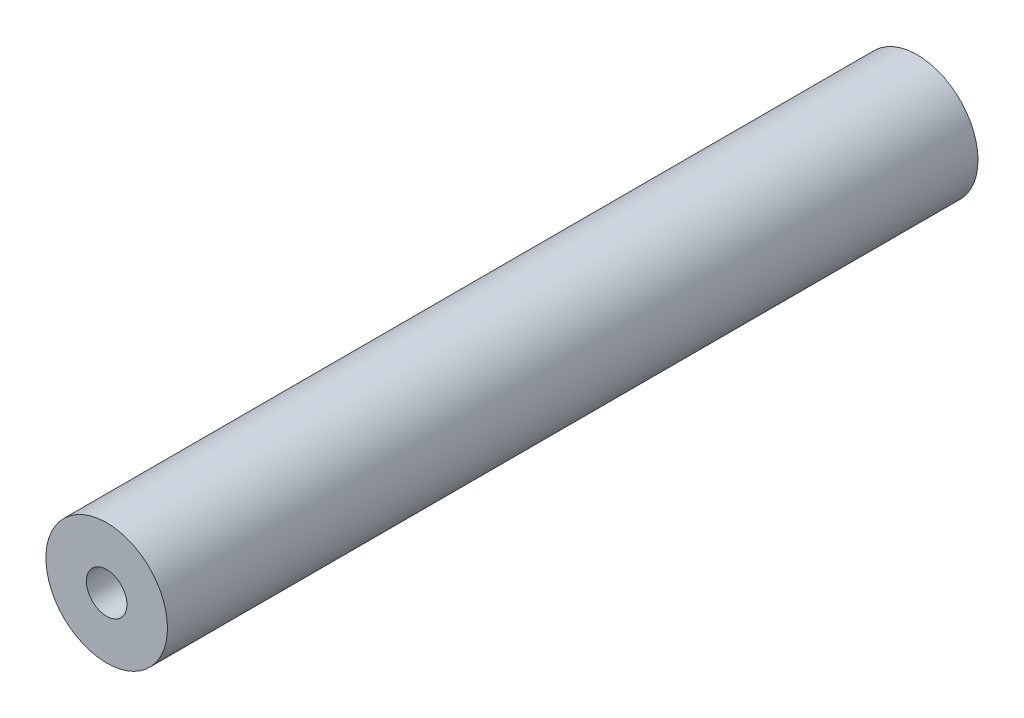
ISO-10303-21;
HEADER;
FILE_DESCRIPTION(('STEP AP214'),'2;1');
FILE_NAME('part.step','',(''),(''),'','','');
FILE_SCHEMA(('AUTOMOTIVE_DESIGN { 1 0 10303 214 1 1 1 1 }'));
ENDSEC;
DATA;
#1=APPLICATION_CONTEXT('core data for automotive mechanical design processes');
#2=APPLICATION_PROTOCOL_DEFINITION('international standard','automotive_design',2000,#1);
#3=PRODUCT_CONTEXT('',#1,'mechanical');
#4=PRODUCT('Part','Part','',(#3));
#5=PRODUCT_RELATED_PRODUCT_CATEGORY('part','',(#4));
#6=PRODUCT_DEFINITION_FORMATION('','',#4);
#7=PRODUCT_DEFINITION_CONTEXT('part definition',#1,'design');
#8=PRODUCT_DEFINITION('design','',#6,#7);
#9=PRODUCT_DEFINITION_SHAPE('','',#8);
#10=(LENGTH_UNIT() NAMED_UNIT(*) SI_UNIT(.MILLI.,.METRE.));
#11=(NAMED_UNIT(*) PLANE_ANGLE_UNIT() SI_UNIT($,.RADIAN.));
#12=(NAMED_UNIT(*) SI_UNIT($,.STERADIAN.) SOLID_ANGLE_UNIT());
#13=UNCERTAINTY_MEASURE_WITH_UNIT(LENGTH_MEASURE(1.E-05),#10,'distance_accuracy_value','');
#14=(GEOMETRIC_REPRESENTATION_CONTEXT(3) GLOBAL_UNCERTAINTY_ASSIGNED_CONTEXT((#13)) GLOBAL_UNIT_ASSIGNED_CONTEXT((#10,
#11,#12)) REPRESENTATION_CONTEXT('',''));
#15=CARTESIAN_POINT('',(0.,0.,0.));
#16=DIRECTION('',(0.,0.,1.));
#17=DIRECTION('',(1.,0.,0.));
#18=AXIS2_PLACEMENT_3D('',#15,#16,#17);
#19=CARTESIAN_POINT('',(0.,0.,20.));
#20=DIRECTION('',(0.,0.,1.));
#21=DIRECTION('',(1.,0.,0.));
#22=AXIS2_PLACEMENT_3D('',#19,#20,#21);
#23=PLANE('',#22);
#24=CARTESIAN_POINT('',(0.,0.,20.));
#25=DIRECTION('',(0.,0.,1.));
#26=DIRECTION('',(1.,0.,0.));
#27=AXIS2_PLACEMENT_3D('',#24,#25,#26);
#28=CIRCLE('',#27,1.5);
#29=CARTESIAN_POINT('',(1.5,0.,20.));
#30=VERTEX_POINT('',#29);
#31=EDGE_CURVE('E10',#30,#30,#28,.T.);
#32=ORIENTED_EDGE('',*,*,#31,.T.);
#33=EDGE_LOOP('',(#32));
#34=FACE_BOUND('',#33,.T.);
#35=CARTESIAN_POINT('',(0.,0.,20.));
#36=DIRECTION('',(0.,0.,1.));
#37=DIRECTION('',(1.,0.,0.));
#38=AXIS2_PLACEMENT_3D('',#35,#36,#37);
#39=CIRCLE('',#38,0.5);
#40=CARTESIAN_POINT('',(0.5,0.,20.));
#41=VERTEX_POINT('',#40);
#42=EDGE_CURVE('E44',#41,#41,#39,.T.);
#43=ORIENTED_EDGE('',*,*,#42,.F.);
#44=EDGE_LOOP('',(#43));
#45=FACE_BOUND('',#44,.T.);
#46=ADVANCED_FACE('F33',(#34,#45),#23,.T.);
#47=CARTESIAN_POINT('',(0.,0.,0.));
#48=DIRECTION('',(0.,0.,1.));
#49=DIRECTION('',(1.,0.,0.));
#50=AXIS2_PLACEMENT_3D('',#47,#48,#49);
#51=PLANE('',#50);
#52=CARTESIAN_POINT('',(0.,0.,0.));
#53=DIRECTION('',(0.,0.,1.));
#54=DIRECTION('',(1.,0.,0.));
#55=AXIS2_PLACEMENT_3D('',#52,#53,#54);
#56=CIRCLE('',#55,1.5);
#57=CARTESIAN_POINT('',(1.5,0.,0.));
#58=VERTEX_POINT('',#57);
#59=EDGE_CURVE('E37',#58,#58,#56,.T.);
#60=ORIENTED_EDGE('',*,*,#59,.F.);
#61=EDGE_LOOP('',(#60));
#62=FACE_BOUND('',#61,.T.);
#63=CARTESIAN_POINT('',(0.,0.,0.));
#64=DIRECTION('',(0.,0.,1.));
#65=DIRECTION('',(1.,0.,0.));
#66=AXIS2_PLACEMENT_3D('',#63,#64,#65);
#67=CIRCLE('',#66,0.5);
#68=CARTESIAN_POINT('',(0.5,0.,0.));
#69=VERTEX_POINT('',#68);
#70=EDGE_CURVE('E46',#69,#69,#67,.T.);
#71=ORIENTED_EDGE('',*,*,#70,.T.);
#72=EDGE_LOOP('',(#71));
#73=FACE_BOUND('',#72,.T.);
#74=ADVANCED_FACE('F56',(#62,#73),#51,.F.);
#75=CARTESIAN_POINT('',(0.,0.,20.));
#76=DIRECTION('',(0.,0.,-1.));
#77=DIRECTION('',(-1.,0.,0.));
#78=AXIS2_PLACEMENT_3D('',#75,#76,#77);
#79=CYLINDRICAL_SURFACE('',#78,1.5);
#80=ORIENTED_EDGE('',*,*,#31,.F.);
#81=EDGE_LOOP('',(#80));
#82=FACE_BOUND('',#81,.T.);
#83=ORIENTED_EDGE('',*,*,#59,.T.);
#84=EDGE_LOOP('',(#83));
#85=FACE_BOUND('',#84,.T.);
#86=ADVANCED_FACE('F35',(#82,#85),#79,.T.);
#87=CARTESIAN_POINT('',(0.,0.,20.));
#88=DIRECTION('',(0.,0.,-1.));
#89=DIRECTION('',(-1.,0.,0.));
#90=AXIS2_PLACEMENT_3D('',#87,#88,#89);
#91=CYLINDRICAL_SURFACE('',#90,0.5);
#92=ORIENTED_EDGE('',*,*,#42,.T.);
#93=EDGE_LOOP('',(#92));
#94=FACE_BOUND('',#93,.T.);
#95=ORIENTED_EDGE('',*,*,#70,.F.);
#96=EDGE_LOOP('',(#95));
#97=FACE_BOUND('',#96,.T.);
#98=ADVANCED_FACE('F52',(#94,#97),#91,.F.);
#99=CLOSED_SHELL('',(#46,#74,#86,#98));
#100=MANIFOLD_SOLID_BREP('B2',#99);
#101=ADVANCED_BREP_SHAPE_REPRESENTATION('',(#18,#100),#14);
#102=SHAPE_DEFINITION_REPRESENTATION(#9,#101);
ENDSEC;
END-ISO-10303-21;
